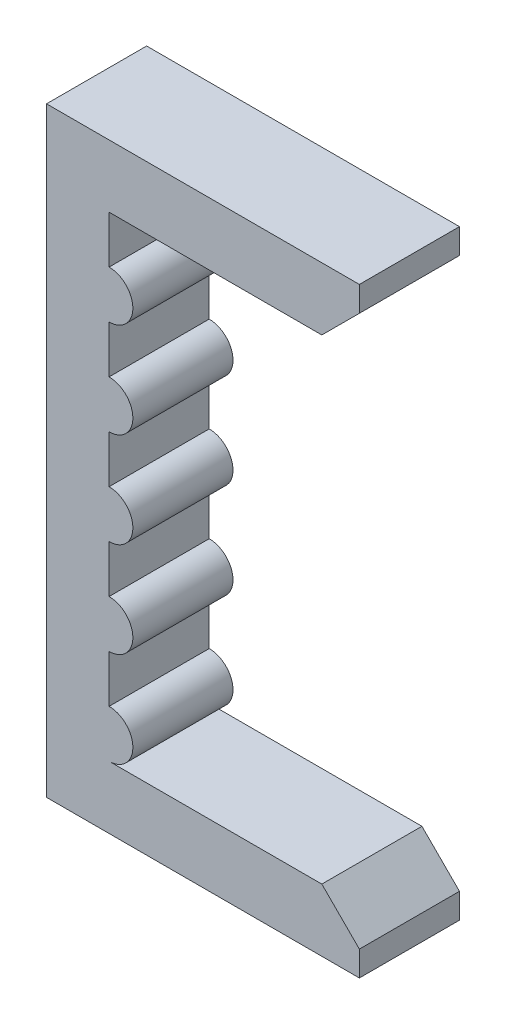
ISO-10303-21;
HEADER;
FILE_DESCRIPTION(('STEP AP214'),'2;1');
FILE_NAME('part.step','',(''),(''),'','','');
FILE_SCHEMA(('AUTOMOTIVE_DESIGN { 1 0 10303 214 1 1 1 1 }'));
ENDSEC;
DATA;
#1=APPLICATION_CONTEXT('core data for automotive mechanical design processes');
#2=APPLICATION_PROTOCOL_DEFINITION('international standard','automotive_design',2000,#1);
#3=PRODUCT_CONTEXT('',#1,'mechanical');
#4=PRODUCT('Part','Part','',(#3));
#5=PRODUCT_RELATED_PRODUCT_CATEGORY('part','',(#4));
#6=PRODUCT_DEFINITION_FORMATION('','',#4);
#7=PRODUCT_DEFINITION_CONTEXT('part definition',#1,'design');
#8=PRODUCT_DEFINITION('design','',#6,#7);
#9=PRODUCT_DEFINITION_SHAPE('','',#8);
#10=(LENGTH_UNIT() NAMED_UNIT(*) SI_UNIT(.MILLI.,.METRE.));
#11=(NAMED_UNIT(*) PLANE_ANGLE_UNIT() SI_UNIT($,.RADIAN.));
#12=(NAMED_UNIT(*) SI_UNIT($,.STERADIAN.) SOLID_ANGLE_UNIT());
#13=UNCERTAINTY_MEASURE_WITH_UNIT(LENGTH_MEASURE(1.E-05),#10,'distance_accuracy_value','');
#14=(GEOMETRIC_REPRESENTATION_CONTEXT(3) GLOBAL_UNCERTAINTY_ASSIGNED_CONTEXT((#13)) GLOBAL_UNIT_ASSIGNED_CONTEXT((#10,
#11,#12)) REPRESENTATION_CONTEXT('',''));
#15=CARTESIAN_POINT('',(0.,0.,0.));
#16=DIRECTION('',(0.,0.,1.));
#17=DIRECTION('',(1.,0.,0.));
#18=AXIS2_PLACEMENT_3D('',#15,#16,#17);
#19=CARTESIAN_POINT('',(5.,43.,8.));
#20=DIRECTION('',(1.,0.,0.));
#21=DIRECTION('',(0.,1.,0.));
#22=AXIS2_PLACEMENT_3D('',#19,#20,#21);
#23=PLANE('',#22);
#24=DIRECTION('',(0.,-1.,0.));
#25=VECTOR('',#24,1.);
#26=CARTESIAN_POINT('',(5.,43.,0.));
#27=LINE('',#26,#25);
#28=CARTESIAN_POINT('',(5.,35.4,0.));
#29=VERTEX_POINT('',#28);
#30=CARTESIAN_POINT('',(5.,31.6,0.));
#31=VERTEX_POINT('',#30);
#32=EDGE_CURVE('E180',#29,#31,#27,.T.);
#33=ORIENTED_EDGE('',*,*,#32,.F.);
#34=DIRECTION('',(0.,0.,-1.));
#35=VECTOR('',#34,1.);
#36=CARTESIAN_POINT('',(5.,35.4,13.3740115370178));
#37=LINE('',#36,#35);
#38=CARTESIAN_POINT('',(5.,35.4,8.));
#39=VERTEX_POINT('',#38);
#40=EDGE_CURVE('E179',#29,#39,#37,.F.);
#41=ORIENTED_EDGE('',*,*,#40,.T.);
#42=DIRECTION('',(0.,-1.,0.));
#43=VECTOR('',#42,1.);
#44=CARTESIAN_POINT('',(5.,43.,8.));
#45=LINE('',#44,#43);
#46=CARTESIAN_POINT('',(5.,31.6,8.));
#47=VERTEX_POINT('',#46);
#48=EDGE_CURVE('E163',#39,#47,#45,.T.);
#49=ORIENTED_EDGE('',*,*,#48,.T.);
#50=DIRECTION('',(0.,0.,-1.));
#51=VECTOR('',#50,1.);
#52=CARTESIAN_POINT('',(5.,31.6,13.3740115370178));
#53=LINE('',#52,#51);
#54=EDGE_CURVE('E197',#47,#31,#53,.T.);
#55=ORIENTED_EDGE('',*,*,#54,.T.);
#56=EDGE_LOOP('',(#33,#41,#49,#55));
#57=FACE_BOUND('',#56,.T.);
#58=ADVANCED_FACE('F33',(#57),#23,.T.);
#59=CARTESIAN_POINT('',(5.,43.,8.));
#60=VERTEX_POINT('',#59);
#61=CARTESIAN_POINT('',(5.,39.2,8.));
#62=VERTEX_POINT('',#61);
#63=EDGE_CURVE('E175',#60,#62,#45,.T.);
#64=ORIENTED_EDGE('',*,*,#63,.T.);
#65=DIRECTION('',(0.,0.,-1.));
#66=VECTOR('',#65,1.);
#67=CARTESIAN_POINT('',(5.,39.2,13.3740115370178));
#68=LINE('',#67,#66);
#69=CARTESIAN_POINT('',(5.,39.2,0.));
#70=VERTEX_POINT('',#69);
#71=EDGE_CURVE('E185',#62,#70,#68,.T.);
#72=ORIENTED_EDGE('',*,*,#71,.T.);
#73=CARTESIAN_POINT('',(5.,43.,0.));
#74=VERTEX_POINT('',#73);
#75=EDGE_CURVE('E259',#74,#70,#27,.T.);
#76=ORIENTED_EDGE('',*,*,#75,.F.);
#77=DIRECTION('',(0.,0.,-1.));
#78=VECTOR('',#77,1.);
#79=CARTESIAN_POINT('',(5.,43.,8.));
#80=LINE('',#79,#78);
#81=EDGE_CURVE('E256',#60,#74,#80,.T.);
#82=ORIENTED_EDGE('',*,*,#81,.F.);
#83=EDGE_LOOP('',(#64,#72,#76,#82));
#84=FACE_BOUND('',#83,.T.);
#85=ADVANCED_FACE('F373',(#84),#23,.T.);
#86=CARTESIAN_POINT('',(5.,27.8,0.));
#87=VERTEX_POINT('',#86);
#88=CARTESIAN_POINT('',(5.,24.,0.));
#89=VERTEX_POINT('',#88);
#90=EDGE_CURVE('E361',#87,#89,#27,.T.);
#91=ORIENTED_EDGE('',*,*,#90,.F.);
#92=DIRECTION('',(0.,0.,-1.));
#93=VECTOR('',#92,1.);
#94=CARTESIAN_POINT('',(5.,27.8,13.3740115370178));
#95=LINE('',#94,#93);
#96=CARTESIAN_POINT('',(5.,27.8,8.));
#97=VERTEX_POINT('',#96);
#98=EDGE_CURVE('E199',#87,#97,#95,.F.);
#99=ORIENTED_EDGE('',*,*,#98,.T.);
#100=CARTESIAN_POINT('',(5.,24.,8.));
#101=VERTEX_POINT('',#100);
#102=EDGE_CURVE('E176',#97,#101,#45,.T.);
#103=ORIENTED_EDGE('',*,*,#102,.T.);
#104=DIRECTION('',(0.,0.,-1.));
#105=VECTOR('',#104,1.);
#106=CARTESIAN_POINT('',(5.,24.,13.3740115370178));
#107=LINE('',#106,#105);
#108=EDGE_CURVE('E208',#101,#89,#107,.T.);
#109=ORIENTED_EDGE('',*,*,#108,.T.);
#110=EDGE_LOOP('',(#91,#99,#103,#109));
#111=FACE_BOUND('',#110,.T.);
#112=ADVANCED_FACE('F355',(#111),#23,.T.);
#113=CARTESIAN_POINT('',(5.,20.2,0.));
#114=VERTEX_POINT('',#113);
#115=CARTESIAN_POINT('',(5.,16.4,0.));
#116=VERTEX_POINT('',#115);
#117=EDGE_CURVE('E350',#114,#116,#27,.T.);
#118=ORIENTED_EDGE('',*,*,#117,.F.);
#119=DIRECTION('',(0.,0.,-1.));
#120=VECTOR('',#119,1.);
#121=CARTESIAN_POINT('',(5.,20.2,13.3740115370178));
#122=LINE('',#121,#120);
#123=CARTESIAN_POINT('',(5.,20.2,8.));
#124=VERTEX_POINT('',#123);
#125=EDGE_CURVE('E211',#114,#124,#122,.F.);
#126=ORIENTED_EDGE('',*,*,#125,.T.);
#127=CARTESIAN_POINT('',(5.,16.4,8.));
#128=VERTEX_POINT('',#127);
#129=EDGE_CURVE('E342',#124,#128,#45,.T.);
#130=ORIENTED_EDGE('',*,*,#129,.T.);
#131=DIRECTION('',(0.,0.,-1.));
#132=VECTOR('',#131,1.);
#133=CARTESIAN_POINT('',(5.,16.4,13.3740115370178));
#134=LINE('',#133,#132);
#135=EDGE_CURVE('E220',#128,#116,#134,.T.);
#136=ORIENTED_EDGE('',*,*,#135,.T.);
#137=EDGE_LOOP('',(#118,#126,#130,#136));
#138=FACE_BOUND('',#137,.T.);
#139=ADVANCED_FACE('F349',(#138),#23,.T.);
#140=CARTESIAN_POINT('',(5.,12.6,0.));
#141=VERTEX_POINT('',#140);
#142=CARTESIAN_POINT('',(5.,8.8,0.));
#143=VERTEX_POINT('',#142);
#144=EDGE_CURVE('E258',#141,#143,#27,.T.);
#145=ORIENTED_EDGE('',*,*,#144,.F.);
#146=DIRECTION('',(0.,0.,-1.));
#147=VECTOR('',#146,1.);
#148=CARTESIAN_POINT('',(5.,12.6,13.3740115370178));
#149=LINE('',#148,#147);
#150=CARTESIAN_POINT('',(5.,12.6,8.));
#151=VERTEX_POINT('',#150);
#152=EDGE_CURVE('E223',#141,#151,#149,.F.);
#153=ORIENTED_EDGE('',*,*,#152,.T.);
#154=CARTESIAN_POINT('',(5.,8.8,8.));
#155=VERTEX_POINT('',#154);
#156=EDGE_CURVE('E237',#151,#155,#45,.T.);
#157=ORIENTED_EDGE('',*,*,#156,.T.);
#158=DIRECTION('',(0.,0.,-1.));
#159=VECTOR('',#158,1.);
#160=CARTESIAN_POINT('',(5.,8.8,13.3740115370178));
#161=LINE('',#160,#159);
#162=EDGE_CURVE('E232',#155,#143,#161,.T.);
#163=ORIENTED_EDGE('',*,*,#162,.T.);
#164=EDGE_LOOP('',(#145,#153,#157,#163));
#165=FACE_BOUND('',#164,.T.);
#166=ADVANCED_FACE('F344',(#165),#23,.T.);
#167=CARTESIAN_POINT('',(25.,43.,8.));
#168=DIRECTION('',(0.,-1.,0.));
#169=DIRECTION('',(1.,0.,0.));
#170=AXIS2_PLACEMENT_3D('',#167,#168,#169);
#171=PLANE('',#170);
#172=DIRECTION('',(-1.,0.,0.));
#173=VECTOR('',#172,1.);
#174=CARTESIAN_POINT('',(25.,43.,0.));
#175=LINE('',#174,#173);
#176=CARTESIAN_POINT('',(22.,43.,0.));
#177=VERTEX_POINT('',#176);
#178=EDGE_CURVE('E235',#177,#74,#175,.T.);
#179=ORIENTED_EDGE('',*,*,#178,.F.);
#180=DIRECTION('',(0.,0.,1.));
#181=VECTOR('',#180,1.);
#182=CARTESIAN_POINT('',(22.,43.,8.));
#183=LINE('',#182,#181);
#184=CARTESIAN_POINT('',(22.,43.,8.));
#185=VERTEX_POINT('',#184);
#186=EDGE_CURVE('E11',#177,#185,#183,.T.);
#187=ORIENTED_EDGE('',*,*,#186,.T.);
#188=DIRECTION('',(-1.,0.,0.));
#189=VECTOR('',#188,1.);
#190=CARTESIAN_POINT('',(25.,43.,8.));
#191=LINE('',#190,#189);
#192=EDGE_CURVE('E236',#185,#60,#191,.T.);
#193=ORIENTED_EDGE('',*,*,#192,.T.);
#194=ORIENTED_EDGE('',*,*,#81,.T.);
#195=EDGE_LOOP('',(#179,#187,#193,#194));
#196=FACE_BOUND('',#195,.T.);
#197=ADVANCED_FACE('F382',(#196),#171,.T.);
#198=CARTESIAN_POINT('',(25.,48.,8.));
#199=DIRECTION('',(1.,0.,0.));
#200=DIRECTION('',(0.,0.,-1.));
#201=AXIS2_PLACEMENT_3D('',#198,#199,#200);
#202=PLANE('',#201);
#203=DIRECTION('',(0.,-1.,0.));
#204=VECTOR('',#203,1.);
#205=CARTESIAN_POINT('',(25.,48.,8.));
#206=LINE('',#205,#204);
#207=CARTESIAN_POINT('',(25.,48.,8.));
#208=VERTEX_POINT('',#207);
#209=CARTESIAN_POINT('',(25.,46.,8.));
#210=VERTEX_POINT('',#209);
#211=EDGE_CURVE('E254',#208,#210,#206,.T.);
#212=ORIENTED_EDGE('',*,*,#211,.T.);
#213=DIRECTION('',(0.,0.,-1.));
#214=VECTOR('',#213,1.);
#215=CARTESIAN_POINT('',(25.,46.,8.));
#216=LINE('',#215,#214);
#217=CARTESIAN_POINT('',(25.,46.,0.));
#218=VERTEX_POINT('',#217);
#219=EDGE_CURVE('E41',#210,#218,#216,.T.);
#220=ORIENTED_EDGE('',*,*,#219,.T.);
#221=DIRECTION('',(0.,-1.,0.));
#222=VECTOR('',#221,1.);
#223=CARTESIAN_POINT('',(25.,48.,0.));
#224=LINE('',#223,#222);
#225=CARTESIAN_POINT('',(25.,48.,0.));
#226=VERTEX_POINT('',#225);
#227=EDGE_CURVE('E238',#226,#218,#224,.T.);
#228=ORIENTED_EDGE('',*,*,#227,.F.);
#229=DIRECTION('',(0.,0.,-1.));
#230=VECTOR('',#229,1.);
#231=CARTESIAN_POINT('',(25.,48.,8.));
#232=LINE('',#231,#230);
#233=EDGE_CURVE('E278',#208,#226,#232,.T.);
#234=ORIENTED_EDGE('',*,*,#233,.F.);
#235=EDGE_LOOP('',(#212,#220,#228,#234));
#236=FACE_BOUND('',#235,.T.);
#237=ADVANCED_FACE('F307',(#236),#202,.T.);
#238=CARTESIAN_POINT('',(0.,48.,8.));
#239=DIRECTION('',(0.,1.,0.));
#240=DIRECTION('',(-1.,0.,0.));
#241=AXIS2_PLACEMENT_3D('',#238,#239,#240);
#242=PLANE('',#241);
#243=DIRECTION('',(1.,0.,0.));
#244=VECTOR('',#243,1.);
#245=CARTESIAN_POINT('',(0.,48.,0.));
#246=LINE('',#245,#244);
#247=CARTESIAN_POINT('',(0.,48.,0.));
#248=VERTEX_POINT('',#247);
#249=EDGE_CURVE('E273',#248,#226,#246,.T.);
#250=ORIENTED_EDGE('',*,*,#249,.F.);
#251=DIRECTION('',(0.,0.,-1.));
#252=VECTOR('',#251,1.);
#253=CARTESIAN_POINT('',(0.,48.,8.));
#254=LINE('',#253,#252);
#255=CARTESIAN_POINT('',(0.,48.,8.));
#256=VERTEX_POINT('',#255);
#257=EDGE_CURVE('E281',#256,#248,#254,.T.);
#258=ORIENTED_EDGE('',*,*,#257,.F.);
#259=DIRECTION('',(1.,0.,0.));
#260=VECTOR('',#259,1.);
#261=CARTESIAN_POINT('',(0.,48.,8.));
#262=LINE('',#261,#260);
#263=EDGE_CURVE('E251',#256,#208,#262,.T.);
#264=ORIENTED_EDGE('',*,*,#263,.T.);
#265=ORIENTED_EDGE('',*,*,#233,.T.);
#266=EDGE_LOOP('',(#250,#258,#264,#265));
#267=FACE_BOUND('',#266,.T.);
#268=ADVANCED_FACE('F314',(#267),#242,.T.);
#269=CARTESIAN_POINT('',(0.,0.,8.));
#270=DIRECTION('',(-1.,0.,0.));
#271=DIRECTION('',(0.,0.,1.));
#272=AXIS2_PLACEMENT_3D('',#269,#270,#271);
#273=PLANE('',#272);
#274=DIRECTION('',(0.,1.,0.));
#275=VECTOR('',#274,1.);
#276=CARTESIAN_POINT('',(0.,0.,0.));
#277=LINE('',#276,#275);
#278=CARTESIAN_POINT('',(0.,0.,0.));
#279=VERTEX_POINT('',#278);
#280=EDGE_CURVE('E270',#279,#248,#277,.T.);
#281=ORIENTED_EDGE('',*,*,#280,.F.);
#282=DIRECTION('',(0.,0.,-1.));
#283=VECTOR('',#282,1.);
#284=CARTESIAN_POINT('',(0.,0.,8.));
#285=LINE('',#284,#283);
#286=CARTESIAN_POINT('',(0.,0.,8.));
#287=VERTEX_POINT('',#286);
#288=EDGE_CURVE('E283',#287,#279,#285,.T.);
#289=ORIENTED_EDGE('',*,*,#288,.F.);
#290=DIRECTION('',(0.,1.,0.));
#291=VECTOR('',#290,1.);
#292=CARTESIAN_POINT('',(0.,0.,8.));
#293=LINE('',#292,#291);
#294=EDGE_CURVE('E248',#287,#256,#293,.T.);
#295=ORIENTED_EDGE('',*,*,#294,.T.);
#296=ORIENTED_EDGE('',*,*,#257,.T.);
#297=EDGE_LOOP('',(#281,#289,#295,#296));
#298=FACE_BOUND('',#297,.T.);
#299=ADVANCED_FACE('F319',(#298),#273,.T.);
#300=CARTESIAN_POINT('',(25.,0.,8.));
#301=DIRECTION('',(0.,-1.,0.));
#302=DIRECTION('',(1.,0.,0.));
#303=AXIS2_PLACEMENT_3D('',#300,#301,#302);
#304=PLANE('',#303);
#305=DIRECTION('',(-1.,0.,0.));
#306=VECTOR('',#305,1.);
#307=CARTESIAN_POINT('',(25.,0.,0.));
#308=LINE('',#307,#306);
#309=CARTESIAN_POINT('',(25.,0.,0.));
#310=VERTEX_POINT('',#309);
#311=EDGE_CURVE('E267',#310,#279,#308,.T.);
#312=ORIENTED_EDGE('',*,*,#311,.F.);
#313=DIRECTION('',(0.,0.,-1.));
#314=VECTOR('',#313,1.);
#315=CARTESIAN_POINT('',(25.,0.,8.));
#316=LINE('',#315,#314);
#317=CARTESIAN_POINT('',(25.,0.,8.));
#318=VERTEX_POINT('',#317);
#319=EDGE_CURVE('E285',#318,#310,#316,.T.);
#320=ORIENTED_EDGE('',*,*,#319,.F.);
#321=DIRECTION('',(-1.,0.,0.));
#322=VECTOR('',#321,1.);
#323=CARTESIAN_POINT('',(25.,0.,8.));
#324=LINE('',#323,#322);
#325=EDGE_CURVE('E245',#318,#287,#324,.T.);
#326=ORIENTED_EDGE('',*,*,#325,.T.);
#327=ORIENTED_EDGE('',*,*,#288,.T.);
#328=EDGE_LOOP('',(#312,#320,#326,#327));
#329=FACE_BOUND('',#328,.T.);
#330=ADVANCED_FACE('F322',(#329),#304,.T.);
#331=CARTESIAN_POINT('',(25.,5.,8.));
#332=DIRECTION('',(1.,0.,0.));
#333=DIRECTION('',(0.,0.,-1.));
#334=AXIS2_PLACEMENT_3D('',#331,#332,#333);
#335=PLANE('',#334);
#336=DIRECTION('',(0.,-1.,0.));
#337=VECTOR('',#336,1.);
#338=CARTESIAN_POINT('',(25.,5.,0.));
#339=LINE('',#338,#337);
#340=CARTESIAN_POINT('',(25.,2.00000000000001,0.));
#341=VERTEX_POINT('',#340);
#342=EDGE_CURVE('E265',#341,#310,#339,.T.);
#343=ORIENTED_EDGE('',*,*,#342,.F.);
#344=DIRECTION('',(0.,0.,1.));
#345=VECTOR('',#344,1.);
#346=CARTESIAN_POINT('',(25.,2.00000000000001,8.));
#347=LINE('',#346,#345);
#348=CARTESIAN_POINT('',(25.,2.00000000000001,8.));
#349=VERTEX_POINT('',#348);
#350=EDGE_CURVE('E299',#341,#349,#347,.T.);
#351=ORIENTED_EDGE('',*,*,#350,.T.);
#352=DIRECTION('',(0.,-1.,0.));
#353=VECTOR('',#352,1.);
#354=CARTESIAN_POINT('',(25.,5.,8.));
#355=LINE('',#354,#353);
#356=EDGE_CURVE('E243',#349,#318,#355,.T.);
#357=ORIENTED_EDGE('',*,*,#356,.T.);
#358=ORIENTED_EDGE('',*,*,#319,.T.);
#359=EDGE_LOOP('',(#343,#351,#357,#358));
#360=FACE_BOUND('',#359,.T.);
#361=ADVANCED_FACE('F422',(#360),#335,.T.);
#362=CARTESIAN_POINT('',(5.,5.,8.));
#363=DIRECTION('',(0.,1.,0.));
#364=DIRECTION('',(0.,0.,1.));
#365=AXIS2_PLACEMENT_3D('',#362,#363,#364);
#366=PLANE('',#365);
#367=DIRECTION('',(1.,0.,0.));
#368=VECTOR('',#367,1.);
#369=CARTESIAN_POINT('',(5.,5.,8.));
#370=LINE('',#369,#368);
#371=CARTESIAN_POINT('',(5.,5.,8.));
#372=VERTEX_POINT('',#371);
#373=CARTESIAN_POINT('',(22.,5.,8.));
#374=VERTEX_POINT('',#373);
#375=EDGE_CURVE('E240',#372,#374,#370,.T.);
#376=ORIENTED_EDGE('',*,*,#375,.T.);
#377=DIRECTION('',(0.,0.,-1.));
#378=VECTOR('',#377,1.);
#379=CARTESIAN_POINT('',(22.,5.,8.));
#380=LINE('',#379,#378);
#381=CARTESIAN_POINT('',(22.,5.,0.));
#382=VERTEX_POINT('',#381);
#383=EDGE_CURVE('E280',#374,#382,#380,.T.);
#384=ORIENTED_EDGE('',*,*,#383,.T.);
#385=DIRECTION('',(1.,0.,0.));
#386=VECTOR('',#385,1.);
#387=CARTESIAN_POINT('',(5.,5.,0.));
#388=LINE('',#387,#386);
#389=CARTESIAN_POINT('',(5.,5.,0.));
#390=VERTEX_POINT('',#389);
#391=EDGE_CURVE('E262',#390,#382,#388,.T.);
#392=ORIENTED_EDGE('',*,*,#391,.F.);
#393=DIRECTION('',(0.,0.,-1.));
#394=VECTOR('',#393,1.);
#395=CARTESIAN_POINT('',(5.,5.,8.));
#396=LINE('',#395,#394);
#397=EDGE_CURVE('E288',#372,#390,#396,.T.);
#398=ORIENTED_EDGE('',*,*,#397,.F.);
#399=EDGE_LOOP('',(#376,#384,#392,#398));
#400=FACE_BOUND('',#399,.T.);
#401=ADVANCED_FACE('F331',(#400),#366,.T.);
#402=CARTESIAN_POINT('',(0.,0.,8.));
#403=DIRECTION('',(0.,0.,1.));
#404=DIRECTION('',(1.,0.,0.));
#405=AXIS2_PLACEMENT_3D('',#402,#403,#404);
#406=PLANE('',#405);
#407=ORIENTED_EDGE('',*,*,#356,.F.);
#408=DIRECTION('',(0.707106781186549,-0.707106781186546,0.));
#409=VECTOR('',#408,1.);
#410=CARTESIAN_POINT('',(13.4999999999999,13.5,8.));
#411=LINE('',#410,#409);
#412=EDGE_CURVE('E302',#349,#374,#411,.F.);
#413=ORIENTED_EDGE('',*,*,#412,.T.);
#414=ORIENTED_EDGE('',*,*,#375,.F.);
#415=CARTESIAN_POINT('',(5.,6.9,8.));
#416=DIRECTION('',(0.,0.,1.));
#417=DIRECTION('',(1.,0.,0.));
#418=AXIS2_PLACEMENT_3D('',#415,#416,#417);
#419=CIRCLE('',#418,1.9);
#420=EDGE_CURVE('E229',#372,#155,#419,.T.);
#421=ORIENTED_EDGE('',*,*,#420,.T.);
#422=ORIENTED_EDGE('',*,*,#156,.F.);
#423=CARTESIAN_POINT('',(5.,14.5,8.));
#424=DIRECTION('',(0.,0.,1.));
#425=DIRECTION('',(1.,0.,0.));
#426=AXIS2_PLACEMENT_3D('',#423,#424,#425);
#427=CIRCLE('',#426,1.9);
#428=EDGE_CURVE('E217',#151,#128,#427,.T.);
#429=ORIENTED_EDGE('',*,*,#428,.T.);
#430=ORIENTED_EDGE('',*,*,#129,.F.);
#431=CARTESIAN_POINT('',(5.,22.1,8.));
#432=DIRECTION('',(0.,0.,1.));
#433=DIRECTION('',(1.,0.,0.));
#434=AXIS2_PLACEMENT_3D('',#431,#432,#433);
#435=CIRCLE('',#434,1.9);
#436=EDGE_CURVE('E205',#124,#101,#435,.T.);
#437=ORIENTED_EDGE('',*,*,#436,.T.);
#438=ORIENTED_EDGE('',*,*,#102,.F.);
#439=CARTESIAN_POINT('',(5.,29.7,8.));
#440=DIRECTION('',(0.,0.,1.));
#441=DIRECTION('',(1.,0.,0.));
#442=AXIS2_PLACEMENT_3D('',#439,#440,#441);
#443=CIRCLE('',#442,1.9);
#444=EDGE_CURVE('E171',#97,#47,#443,.T.);
#445=ORIENTED_EDGE('',*,*,#444,.T.);
#446=ORIENTED_EDGE('',*,*,#48,.F.);
#447=CARTESIAN_POINT('',(4.99999999999999,37.3,8.));
#448=DIRECTION('',(0.,0.,1.));
#449=DIRECTION('',(1.,0.,0.));
#450=AXIS2_PLACEMENT_3D('',#447,#448,#449);
#451=CIRCLE('',#450,1.9);
#452=EDGE_CURVE('E169',#39,#62,#451,.T.);
#453=ORIENTED_EDGE('',*,*,#452,.T.);
#454=ORIENTED_EDGE('',*,*,#63,.F.);
#455=ORIENTED_EDGE('',*,*,#192,.F.);
#456=DIRECTION('',(-0.707106781186549,-0.707106781186546,0.));
#457=VECTOR('',#456,1.);
#458=CARTESIAN_POINT('',(-10.5,10.5000000000001,8.));
#459=LINE('',#458,#457);
#460=EDGE_CURVE('E48',#185,#210,#459,.F.);
#461=ORIENTED_EDGE('',*,*,#460,.T.);
#462=ORIENTED_EDGE('',*,*,#211,.F.);
#463=ORIENTED_EDGE('',*,*,#263,.F.);
#464=ORIENTED_EDGE('',*,*,#294,.F.);
#465=ORIENTED_EDGE('',*,*,#325,.F.);
#466=EDGE_LOOP('',(#407,#413,#414,#421,#422,#429,#430,#437,#438,#445,#446,#453,#454,#455,#461,
#462,#463,#464,#465));
#467=FACE_BOUND('',#466,.T.);
#468=ADVANCED_FACE('F166',(#467),#406,.T.);
#469=CARTESIAN_POINT('',(0.,0.,0.));
#470=DIRECTION('',(0.,0.,1.));
#471=DIRECTION('',(1.,0.,0.));
#472=AXIS2_PLACEMENT_3D('',#469,#470,#471);
#473=PLANE('',#472);
#474=ORIENTED_EDGE('',*,*,#391,.T.);
#475=DIRECTION('',(-0.707106781186549,0.707106781186546,0.));
#476=VECTOR('',#475,1.);
#477=CARTESIAN_POINT('',(22.,5.,0.));
#478=LINE('',#477,#476);
#479=EDGE_CURVE('E297',#382,#341,#478,.F.);
#480=ORIENTED_EDGE('',*,*,#479,.T.);
#481=ORIENTED_EDGE('',*,*,#342,.T.);
#482=ORIENTED_EDGE('',*,*,#311,.T.);
#483=ORIENTED_EDGE('',*,*,#280,.T.);
#484=ORIENTED_EDGE('',*,*,#249,.T.);
#485=ORIENTED_EDGE('',*,*,#227,.T.);
#486=DIRECTION('',(0.707106781186549,0.707106781186546,0.));
#487=VECTOR('',#486,1.);
#488=CARTESIAN_POINT('',(25.,46.,0.));
#489=LINE('',#488,#487);
#490=EDGE_CURVE('E295',#218,#177,#489,.F.);
#491=ORIENTED_EDGE('',*,*,#490,.T.);
#492=ORIENTED_EDGE('',*,*,#178,.T.);
#493=ORIENTED_EDGE('',*,*,#75,.T.);
#494=CARTESIAN_POINT('',(4.99999999999999,37.3,0.));
#495=DIRECTION('',(0.,0.,1.));
#496=DIRECTION('',(1.,0.,0.));
#497=AXIS2_PLACEMENT_3D('',#494,#495,#496);
#498=CIRCLE('',#497,1.9);
#499=EDGE_CURVE('E189',#29,#70,#498,.T.);
#500=ORIENTED_EDGE('',*,*,#499,.F.);
#501=ORIENTED_EDGE('',*,*,#32,.T.);
#502=CARTESIAN_POINT('',(5.,29.7,0.));
#503=DIRECTION('',(0.,0.,1.));
#504=DIRECTION('',(1.,0.,0.));
#505=AXIS2_PLACEMENT_3D('',#502,#503,#504);
#506=CIRCLE('',#505,1.9);
#507=EDGE_CURVE('E184',#87,#31,#506,.T.);
#508=ORIENTED_EDGE('',*,*,#507,.F.);
#509=ORIENTED_EDGE('',*,*,#90,.T.);
#510=CARTESIAN_POINT('',(5.,22.1,0.));
#511=DIRECTION('',(0.,0.,1.));
#512=DIRECTION('',(1.,0.,0.));
#513=AXIS2_PLACEMENT_3D('',#510,#511,#512);
#514=CIRCLE('',#513,1.9);
#515=EDGE_CURVE('E202',#114,#89,#514,.T.);
#516=ORIENTED_EDGE('',*,*,#515,.F.);
#517=ORIENTED_EDGE('',*,*,#117,.T.);
#518=CARTESIAN_POINT('',(5.,14.5,0.));
#519=DIRECTION('',(0.,0.,1.));
#520=DIRECTION('',(1.,0.,0.));
#521=AXIS2_PLACEMENT_3D('',#518,#519,#520);
#522=CIRCLE('',#521,1.9);
#523=EDGE_CURVE('E214',#141,#116,#522,.T.);
#524=ORIENTED_EDGE('',*,*,#523,.F.);
#525=ORIENTED_EDGE('',*,*,#144,.T.);
#526=CARTESIAN_POINT('',(5.,6.9,0.));
#527=DIRECTION('',(0.,0.,1.));
#528=DIRECTION('',(1.,0.,0.));
#529=AXIS2_PLACEMENT_3D('',#526,#527,#528);
#530=CIRCLE('',#529,1.9);
#531=EDGE_CURVE('E226',#390,#143,#530,.T.);
#532=ORIENTED_EDGE('',*,*,#531,.F.);
#533=EDGE_LOOP('',(#474,#480,#481,#482,#483,#484,#485,#491,#492,#493,#500,#501,#508,#509,#516,
#517,#524,#525,#532));
#534=FACE_BOUND('',#533,.T.);
#535=ADVANCED_FACE('F310',(#534),#473,.F.);
#536=CARTESIAN_POINT('',(5.,6.9,13.3740115370178));
#537=DIRECTION('',(0.,0.,-1.));
#538=DIRECTION('',(-1.,0.,0.));
#539=AXIS2_PLACEMENT_3D('',#536,#537,#538);
#540=CYLINDRICAL_SURFACE('',#539,1.9);
#541=ORIENTED_EDGE('',*,*,#397,.T.);
#542=ORIENTED_EDGE('',*,*,#531,.T.);
#543=ORIENTED_EDGE('',*,*,#162,.F.);
#544=ORIENTED_EDGE('',*,*,#420,.F.);
#545=EDGE_LOOP('',(#541,#542,#543,#544));
#546=FACE_BOUND('',#545,.T.);
#547=ADVANCED_FACE('F338',(#546),#540,.T.);
#548=CARTESIAN_POINT('',(5.,14.5,13.3740115370178));
#549=DIRECTION('',(0.,0.,-1.));
#550=DIRECTION('',(-1.,0.,0.));
#551=AXIS2_PLACEMENT_3D('',#548,#549,#550);
#552=CYLINDRICAL_SURFACE('',#551,1.9);
#553=ORIENTED_EDGE('',*,*,#152,.F.);
#554=ORIENTED_EDGE('',*,*,#523,.T.);
#555=ORIENTED_EDGE('',*,*,#135,.F.);
#556=ORIENTED_EDGE('',*,*,#428,.F.);
#557=EDGE_LOOP('',(#553,#554,#555,#556));
#558=FACE_BOUND('',#557,.T.);
#559=ADVANCED_FACE('F347',(#558),#552,.T.);
#560=CARTESIAN_POINT('',(5.,22.1,13.3740115370178));
#561=DIRECTION('',(0.,0.,-1.));
#562=DIRECTION('',(-1.,0.,0.));
#563=AXIS2_PLACEMENT_3D('',#560,#561,#562);
#564=CYLINDRICAL_SURFACE('',#563,1.9);
#565=ORIENTED_EDGE('',*,*,#125,.F.);
#566=ORIENTED_EDGE('',*,*,#515,.T.);
#567=ORIENTED_EDGE('',*,*,#108,.F.);
#568=ORIENTED_EDGE('',*,*,#436,.F.);
#569=EDGE_LOOP('',(#565,#566,#567,#568));
#570=FACE_BOUND('',#569,.T.);
#571=ADVANCED_FACE('F358',(#570),#564,.T.);
#572=CARTESIAN_POINT('',(5.,29.7,13.3740115370178));
#573=DIRECTION('',(0.,0.,-1.));
#574=DIRECTION('',(-1.,0.,0.));
#575=AXIS2_PLACEMENT_3D('',#572,#573,#574);
#576=CYLINDRICAL_SURFACE('',#575,1.9);
#577=ORIENTED_EDGE('',*,*,#98,.F.);
#578=ORIENTED_EDGE('',*,*,#507,.T.);
#579=ORIENTED_EDGE('',*,*,#54,.F.);
#580=ORIENTED_EDGE('',*,*,#444,.F.);
#581=EDGE_LOOP('',(#577,#578,#579,#580));
#582=FACE_BOUND('',#581,.T.);
#583=ADVANCED_FACE('F363',(#582),#576,.T.);
#584=CARTESIAN_POINT('',(4.99999999999999,37.3,13.3740115370178));
#585=DIRECTION('',(0.,0.,-1.));
#586=DIRECTION('',(-1.,0.,0.));
#587=AXIS2_PLACEMENT_3D('',#584,#585,#586);
#588=CYLINDRICAL_SURFACE('',#587,1.9);
#589=ORIENTED_EDGE('',*,*,#40,.F.);
#590=ORIENTED_EDGE('',*,*,#499,.T.);
#591=ORIENTED_EDGE('',*,*,#71,.F.);
#592=ORIENTED_EDGE('',*,*,#452,.F.);
#593=EDGE_LOOP('',(#589,#590,#591,#592));
#594=FACE_BOUND('',#593,.T.);
#595=ADVANCED_FACE('F188',(#594),#588,.T.);
#596=CARTESIAN_POINT('',(22.,5.,8.));
#597=DIRECTION('',(-0.707106781186546,-0.707106781186549,0.));
#598=DIRECTION('',(0.,0.,-1.));
#599=AXIS2_PLACEMENT_3D('',#596,#597,#598);
#600=PLANE('',#599);
#601=ORIENTED_EDGE('',*,*,#412,.F.);
#602=ORIENTED_EDGE('',*,*,#350,.F.);
#603=ORIENTED_EDGE('',*,*,#479,.F.);
#604=ORIENTED_EDGE('',*,*,#383,.F.);
#605=EDGE_LOOP('',(#601,#602,#603,#604));
#606=FACE_BOUND('',#605,.T.);
#607=ADVANCED_FACE('F329',(#606),#600,.F.);
#608=CARTESIAN_POINT('',(25.,46.,8.));
#609=DIRECTION('',(-0.707106781186546,0.707106781186549,0.));
#610=DIRECTION('',(0.,0.,-1.));
#611=AXIS2_PLACEMENT_3D('',#608,#609,#610);
#612=PLANE('',#611);
#613=ORIENTED_EDGE('',*,*,#460,.F.);
#614=ORIENTED_EDGE('',*,*,#186,.F.);
#615=ORIENTED_EDGE('',*,*,#490,.F.);
#616=ORIENTED_EDGE('',*,*,#219,.F.);
#617=EDGE_LOOP('',(#613,#614,#615,#616));
#618=FACE_BOUND('',#617,.T.);
#619=ADVANCED_FACE('F35',(#618),#612,.F.);
#620=CLOSED_SHELL('',(#58,#85,#112,#139,#166,#197,#237,#268,#299,#330,#361,#401,#468,#535,#547,
#559,#571,#583,#595,#607,#619));
#621=MANIFOLD_SOLID_BREP('B2',#620);
#622=ADVANCED_BREP_SHAPE_REPRESENTATION('',(#18,#621),#14);
#623=SHAPE_DEFINITION_REPRESENTATION(#9,#622);
ENDSEC;
END-ISO-10303-21;
